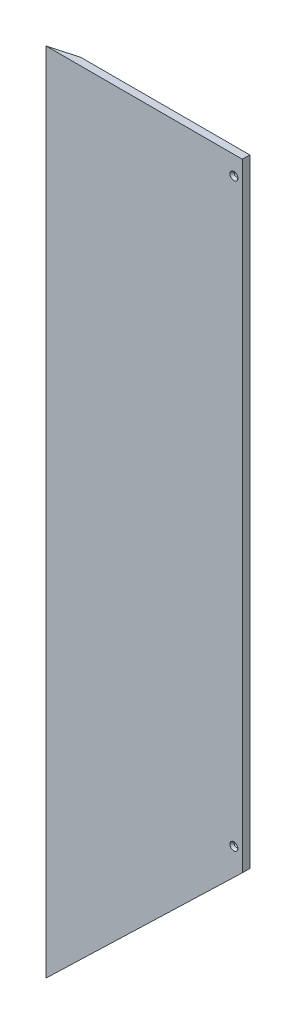
ISO-10303-21;
HEADER;
FILE_DESCRIPTION(('STEP AP214'),'2;1');
FILE_NAME('part.step','',(''),(''),'','','');
FILE_SCHEMA(('AUTOMOTIVE_DESIGN { 1 0 10303 214 1 1 1 1 }'));
ENDSEC;
DATA;
#1=APPLICATION_CONTEXT('core data for automotive mechanical design processes');
#2=APPLICATION_PROTOCOL_DEFINITION('international standard','automotive_design',2000,#1);
#3=PRODUCT_CONTEXT('',#1,'mechanical');
#4=PRODUCT('Part','Part','',(#3));
#5=PRODUCT_RELATED_PRODUCT_CATEGORY('part','',(#4));
#6=PRODUCT_DEFINITION_FORMATION('','',#4);
#7=PRODUCT_DEFINITION_CONTEXT('part definition',#1,'design');
#8=PRODUCT_DEFINITION('design','',#6,#7);
#9=PRODUCT_DEFINITION_SHAPE('','',#8);
#10=(LENGTH_UNIT() NAMED_UNIT(*) SI_UNIT(.MILLI.,.METRE.));
#11=(NAMED_UNIT(*) PLANE_ANGLE_UNIT() SI_UNIT($,.RADIAN.));
#12=(NAMED_UNIT(*) SI_UNIT($,.STERADIAN.) SOLID_ANGLE_UNIT());
#13=UNCERTAINTY_MEASURE_WITH_UNIT(LENGTH_MEASURE(1.E-05),#10,'distance_accuracy_value','');
#14=(GEOMETRIC_REPRESENTATION_CONTEXT(3) GLOBAL_UNCERTAINTY_ASSIGNED_CONTEXT((#13)) GLOBAL_UNIT_ASSIGNED_CONTEXT((#10,
#11,#12)) REPRESENTATION_CONTEXT('',''));
#15=CARTESIAN_POINT('',(0.,0.,0.));
#16=DIRECTION('',(0.,0.,1.));
#17=DIRECTION('',(1.,0.,0.));
#18=AXIS2_PLACEMENT_3D('',#15,#16,#17);
#19=CARTESIAN_POINT('',(-1480.98408110292,1371.6,12.7020000000002));
#20=DIRECTION('',(0.,-1.,0.));
#21=DIRECTION('',(-0.26471698178117,0.,-0.964326147917118));
#22=AXIS2_PLACEMENT_3D('',#19,#20,#21);
#23=PLANE('',#22);
#24=DIRECTION('',(0.964326147917118,0.,-0.26471698178117));
#25=VECTOR('',#24,1.);
#26=CARTESIAN_POINT('',(-61.2393104383737,1371.6,-422.666784086401));
#27=LINE('',#26,#25);
#28=CARTESIAN_POINT('',(-1647.21830961026,1371.6,12.7000000000002));
#29=VERTEX_POINT('',#28);
#30=CARTESIAN_POINT('',(-1600.95402389598,1371.6,2.22044604925031E-13));
#31=VERTEX_POINT('',#30);
#32=EDGE_CURVE('E99',#29,#31,#27,.T.);
#33=ORIENTED_EDGE('',*,*,#32,.F.);
#34=DIRECTION('',(-1.,0.,0.));
#35=VECTOR('',#34,1.);
#36=CARTESIAN_POINT('',(-1480.98408110292,1371.6,12.7000000000001));
#37=LINE('',#36,#35);
#38=CARTESIAN_POINT('',(-1314.74985259558,1371.6,12.7000000000002));
#39=VERTEX_POINT('',#38);
#40=EDGE_CURVE('E104',#39,#29,#37,.T.);
#41=ORIENTED_EDGE('',*,*,#40,.F.);
#42=DIRECTION('',(0.,0.,-1.));
#43=VECTOR('',#42,1.);
#44=CARTESIAN_POINT('',(-1314.74985259558,1371.6,12.7019999999997));
#45=LINE('',#44,#43);
#46=CARTESIAN_POINT('',(-1314.74985259558,1371.6,0.));
#47=VERTEX_POINT('',#46);
#48=EDGE_CURVE('E73',#39,#47,#45,.T.);
#49=ORIENTED_EDGE('',*,*,#48,.T.);
#50=DIRECTION('',(-1.,0.,0.));
#51=VECTOR('',#50,1.);
#52=CARTESIAN_POINT('',(-1480.98408110292,1371.6,-1.11022302462516E-13));
#53=LINE('',#52,#51);
#54=EDGE_CURVE('E106',#47,#31,#53,.T.);
#55=ORIENTED_EDGE('',*,*,#54,.T.);
#56=EDGE_LOOP('',(#33,#41,#49,#55));
#57=FACE_BOUND('',#56,.T.);
#58=ADVANCED_FACE('F42',(#57),#23,.F.);
#59=CARTESIAN_POINT('',(-1480.98408110292,687.420986771541,0.));
#60=DIRECTION('',(0.,0.,1.));
#61=DIRECTION('',(1.,0.,0.));
#62=AXIS2_PLACEMENT_3D('',#59,#60,#61);
#63=PLANE('',#62);
#64=CARTESIAN_POINT('',(-1329.03735259558,355.6,-3.33066907387547E-13));
#65=DIRECTION('',(0.,0.,1.));
#66=DIRECTION('',(1.,0.,0.));
#67=AXIS2_PLACEMENT_3D('',#64,#65,#66);
#68=CIRCLE('',#67,3.3782);
#69=CARTESIAN_POINT('',(-1325.65915259558,355.6,-3.33254435158636E-13));
#70=VERTEX_POINT('',#69);
#71=EDGE_CURVE('E46',#70,#70,#68,.F.);
#72=ORIENTED_EDGE('',*,*,#71,.F.);
#73=EDGE_LOOP('',(#72));
#74=FACE_BOUND('',#73,.T.);
#75=CARTESIAN_POINT('',(-1329.03735259558,1339.85,-3.88578058618805E-13));
#76=DIRECTION('',(0.,0.,1.));
#77=DIRECTION('',(1.,0.,0.));
#78=AXIS2_PLACEMENT_3D('',#75,#76,#77);
#79=CIRCLE('',#78,3.3782);
#80=CARTESIAN_POINT('',(-1325.65915259558,1339.85,-3.88765586389894E-13));
#81=VERTEX_POINT('',#80);
#82=EDGE_CURVE('E108',#81,#81,#79,.F.);
#83=ORIENTED_EDGE('',*,*,#82,.F.);
#84=EDGE_LOOP('',(#83));
#85=FACE_BOUND('',#84,.T.);
#86=DIRECTION('',(0.,-1.,0.));
#87=VECTOR('',#86,1.);
#88=CARTESIAN_POINT('',(-1600.95402389598,687.420986771541,2.22044604925031E-13));
#89=LINE('',#88,#87);
#90=CARTESIAN_POINT('',(-1600.95402389598,47.8558339720756,2.77555756156289E-13));
#91=VERTEX_POINT('',#90);
#92=EDGE_CURVE('E63',#31,#91,#89,.T.);
#93=ORIENTED_EDGE('',*,*,#92,.F.);
#94=ORIENTED_EDGE('',*,*,#54,.F.);
#95=DIRECTION('',(0.,-1.,0.));
#96=VECTOR('',#95,1.);
#97=CARTESIAN_POINT('',(-1314.74985259558,847.725,0.));
#98=LINE('',#97,#96);
#99=CARTESIAN_POINT('',(-1314.74985259558,323.85,0.));
#100=VERTEX_POINT('',#99);
#101=EDGE_CURVE('E52',#47,#100,#98,.T.);
#102=ORIENTED_EDGE('',*,*,#101,.T.);
#103=DIRECTION('',(-0.719829752215674,-0.694150652110275,0.));
#104=VECTOR('',#103,1.);
#105=CARTESIAN_POINT('',(-1480.98408110292,163.545986771541,1.66533453693773E-13));
#106=LINE('',#105,#104);
#107=EDGE_CURVE('E127',#100,#91,#106,.T.);
#108=ORIENTED_EDGE('',*,*,#107,.T.);
#109=EDGE_LOOP('',(#93,#94,#102,#108));
#110=FACE_BOUND('',#109,.T.);
#111=ADVANCED_FACE('F166',(#74,#85,#110),#63,.F.);
#112=CARTESIAN_POINT('',(-1480.98408110292,163.545986771541,12.702));
#113=DIRECTION('',(0.694150652110275,-0.719829752215675,0.));
#114=DIRECTION('',(0.706175147076652,0.680983159335232,-0.193852001158297));
#115=AXIS2_PLACEMENT_3D('',#112,#113,#114);
#116=PLANE('',#115);
#117=DIRECTION('',(-0.719829752215674,-0.694150652110275,0.));
#118=VECTOR('',#117,1.);
#119=CARTESIAN_POINT('',(-1480.98408110292,163.545986771541,12.6999999999998));
#120=LINE('',#119,#118);
#121=CARTESIAN_POINT('',(-1314.74985259558,323.85,12.7000000000002));
#122=VERTEX_POINT('',#121);
#123=CARTESIAN_POINT('',(-1647.21830961026,3.24197354308218,12.7000000000002));
#124=VERTEX_POINT('',#123);
#125=EDGE_CURVE('E120',#122,#124,#120,.T.);
#126=ORIENTED_EDGE('',*,*,#125,.T.);
#127=DIRECTION('',(0.706175147076652,0.680983159335232,-0.193852001158297));
#128=VECTOR('',#127,1.);
#129=CARTESIAN_POINT('',(-1487.23120419546,157.521722624146,-31.218028937396));
#130=LINE('',#129,#128);
#131=EDGE_CURVE('E11',#124,#91,#130,.T.);
#132=ORIENTED_EDGE('',*,*,#131,.T.);
#133=ORIENTED_EDGE('',*,*,#107,.F.);
#134=DIRECTION('',(0.,0.,-1.));
#135=VECTOR('',#134,1.);
#136=CARTESIAN_POINT('',(-1314.74985259558,323.85,12.7019999999998));
#137=LINE('',#136,#135);
#138=EDGE_CURVE('E126',#122,#100,#137,.T.);
#139=ORIENTED_EDGE('',*,*,#138,.F.);
#140=EDGE_LOOP('',(#126,#132,#133,#139));
#141=FACE_BOUND('',#140,.T.);
#142=ADVANCED_FACE('F44',(#141),#116,.T.);
#143=CARTESIAN_POINT('',(-1311.38794692696,660.4,12.7));
#144=DIRECTION('',(0.,0.,1.));
#145=DIRECTION('',(0.,1.,0.));
#146=AXIS2_PLACEMENT_3D('',#143,#144,#145);
#147=PLANE('',#146);
#148=CARTESIAN_POINT('',(-1329.03735259558,355.6,12.7000000000008));
#149=DIRECTION('',(0.,0.,1.));
#150=DIRECTION('',(1.,0.,0.));
#151=AXIS2_PLACEMENT_3D('',#148,#149,#150);
#152=CIRCLE('',#151,6.7437);
#153=CARTESIAN_POINT('',(-1322.29365259558,355.6,12.7000000000008));
#154=VERTEX_POINT('',#153);
#155=EDGE_CURVE('E209',#154,#154,#152,.T.);
#156=ORIENTED_EDGE('',*,*,#155,.F.);
#157=EDGE_LOOP('',(#156));
#158=FACE_BOUND('',#157,.T.);
#159=CARTESIAN_POINT('',(-1329.03735259558,1339.85,12.7000000000008));
#160=DIRECTION('',(0.,0.,1.));
#161=DIRECTION('',(1.,0.,0.));
#162=AXIS2_PLACEMENT_3D('',#159,#160,#161);
#163=CIRCLE('',#162,6.74369999999991);
#164=CARTESIAN_POINT('',(-1322.29365259558,1339.85,12.7000000000008));
#165=VERTEX_POINT('',#164);
#166=EDGE_CURVE('E138',#165,#165,#163,.T.);
#167=ORIENTED_EDGE('',*,*,#166,.F.);
#168=EDGE_LOOP('',(#167));
#169=FACE_BOUND('',#168,.T.);
#170=DIRECTION('',(0.,-1.,0.));
#171=VECTOR('',#170,1.);
#172=CARTESIAN_POINT('',(-1314.74985259558,847.725,12.7));
#173=LINE('',#172,#171);
#174=EDGE_CURVE('E113',#39,#122,#173,.T.);
#175=ORIENTED_EDGE('',*,*,#174,.F.);
#176=ORIENTED_EDGE('',*,*,#40,.T.);
#177=DIRECTION('',(0.,-1.,0.));
#178=VECTOR('',#177,1.);
#179=CARTESIAN_POINT('',(-1647.21830961026,687.420986771541,12.7000000000001));
#180=LINE('',#179,#178);
#181=EDGE_CURVE('E96',#29,#124,#180,.T.);
#182=ORIENTED_EDGE('',*,*,#181,.T.);
#183=ORIENTED_EDGE('',*,*,#125,.F.);
#184=EDGE_LOOP('',(#175,#176,#182,#183));
#185=FACE_BOUND('',#184,.T.);
#186=ADVANCED_FACE('F111',(#158,#169,#185),#147,.T.);
#187=CARTESIAN_POINT('',(-1314.74985259558,847.725,12.7019999999997));
#188=DIRECTION('',(1.,0.,0.));
#189=DIRECTION('',(0.,0.,-1.));
#190=AXIS2_PLACEMENT_3D('',#187,#188,#189);
#191=PLANE('',#190);
#192=ORIENTED_EDGE('',*,*,#48,.F.);
#193=ORIENTED_EDGE('',*,*,#174,.T.);
#194=ORIENTED_EDGE('',*,*,#138,.T.);
#195=ORIENTED_EDGE('',*,*,#101,.F.);
#196=EDGE_LOOP('',(#192,#193,#194,#195));
#197=FACE_BOUND('',#196,.T.);
#198=ADVANCED_FACE('F163',(#197),#191,.T.);
#199=CARTESIAN_POINT('',(-61.2393104383733,685.8,-422.666784086401));
#200=DIRECTION('',(-0.26471698178117,0.,-0.964326147917118));
#201=DIRECTION('',(0.964326147917118,0.,-0.26471698178117));
#202=AXIS2_PLACEMENT_3D('',#199,#200,#201);
#203=PLANE('',#202);
#204=ORIENTED_EDGE('',*,*,#92,.T.);
#205=ORIENTED_EDGE('',*,*,#131,.F.);
#206=ORIENTED_EDGE('',*,*,#181,.F.);
#207=ORIENTED_EDGE('',*,*,#32,.T.);
#208=EDGE_LOOP('',(#204,#205,#206,#207));
#209=FACE_BOUND('',#208,.T.);
#210=ADVANCED_FACE('F98',(#209),#203,.T.);
#211=CARTESIAN_POINT('',(-1329.03735259558,1339.85,-3553.21699062703));
#212=DIRECTION('',(0.,0.,1.));
#213=DIRECTION('',(1.,0.,0.));
#214=AXIS2_PLACEMENT_3D('',#211,#212,#213);
#215=CYLINDRICAL_SURFACE('',#214,3.3782);
#216=CARTESIAN_POINT('',(-1329.03735259558,1339.85,8.82843512549863));
#217=DIRECTION('',(0.,0.,1.));
#218=DIRECTION('',(1.,0.,0.));
#219=AXIS2_PLACEMENT_3D('',#216,#217,#218);
#220=CIRCLE('',#219,3.3782);
#221=CARTESIAN_POINT('',(-1325.65915259558,1339.85,8.82843512549863));
#222=VERTEX_POINT('',#221);
#223=EDGE_CURVE('E130',#222,#222,#220,.T.);
#224=ORIENTED_EDGE('',*,*,#223,.T.);
#225=EDGE_LOOP('',(#224));
#226=FACE_BOUND('',#225,.T.);
#227=ORIENTED_EDGE('',*,*,#82,.T.);
#228=EDGE_LOOP('',(#227));
#229=FACE_BOUND('',#228,.T.);
#230=ADVANCED_FACE('F186',(#226,#229),#215,.F.);
#231=CARTESIAN_POINT('',(-1329.03735259558,1339.85,8.82843512549863));
#232=DIRECTION('',(0.,0.,1.));
#233=DIRECTION('',(1.,0.,0.));
#234=AXIS2_PLACEMENT_3D('',#231,#232,#233);
#235=CONICAL_SURFACE('',#234,3.3782,0.715584993317671);
#236=ORIENTED_EDGE('',*,*,#166,.T.);
#237=EDGE_LOOP('',(#236));
#238=FACE_BOUND('',#237,.T.);
#239=ORIENTED_EDGE('',*,*,#223,.F.);
#240=EDGE_LOOP('',(#239));
#241=FACE_BOUND('',#240,.T.);
#242=ADVANCED_FACE('F190',(#238,#241),#235,.F.);
#243=CARTESIAN_POINT('',(-1329.03735259558,355.6,-3553.21699062703));
#244=DIRECTION('',(0.,0.,1.));
#245=DIRECTION('',(1.,0.,0.));
#246=AXIS2_PLACEMENT_3D('',#243,#244,#245);
#247=CYLINDRICAL_SURFACE('',#246,3.3782);
#248=CARTESIAN_POINT('',(-1329.03735259558,355.6,8.82843512549697));
#249=DIRECTION('',(0.,0.,1.));
#250=DIRECTION('',(1.,0.,0.));
#251=AXIS2_PLACEMENT_3D('',#248,#249,#250);
#252=CIRCLE('',#251,3.3782);
#253=CARTESIAN_POINT('',(-1325.65915259558,355.6,8.82843512549697));
#254=VERTEX_POINT('',#253);
#255=EDGE_CURVE('E212',#254,#254,#252,.T.);
#256=ORIENTED_EDGE('',*,*,#255,.T.);
#257=EDGE_LOOP('',(#256));
#258=FACE_BOUND('',#257,.T.);
#259=ORIENTED_EDGE('',*,*,#71,.T.);
#260=EDGE_LOOP('',(#259));
#261=FACE_BOUND('',#260,.T.);
#262=ADVANCED_FACE('F194',(#258,#261),#247,.F.);
#263=CARTESIAN_POINT('',(-1329.03735259558,355.6,8.82843512549697));
#264=DIRECTION('',(0.,0.,1.));
#265=DIRECTION('',(1.,0.,0.));
#266=AXIS2_PLACEMENT_3D('',#263,#264,#265);
#267=CONICAL_SURFACE('',#266,3.3782,0.715584993317453);
#268=ORIENTED_EDGE('',*,*,#155,.T.);
#269=EDGE_LOOP('',(#268));
#270=FACE_BOUND('',#269,.T.);
#271=ORIENTED_EDGE('',*,*,#255,.F.);
#272=EDGE_LOOP('',(#271));
#273=FACE_BOUND('',#272,.T.);
#274=ADVANCED_FACE('F200',(#270,#273),#267,.F.);
#275=CLOSED_SHELL('',(#58,#111,#142,#186,#198,#210,#230,#242,#262,#274));
#276=MANIFOLD_SOLID_BREP('B2',#275);
#277=ADVANCED_BREP_SHAPE_REPRESENTATION('',(#18,#276),#14);
#278=SHAPE_DEFINITION_REPRESENTATION(#9,#277);
ENDSEC;
END-ISO-10303-21;
